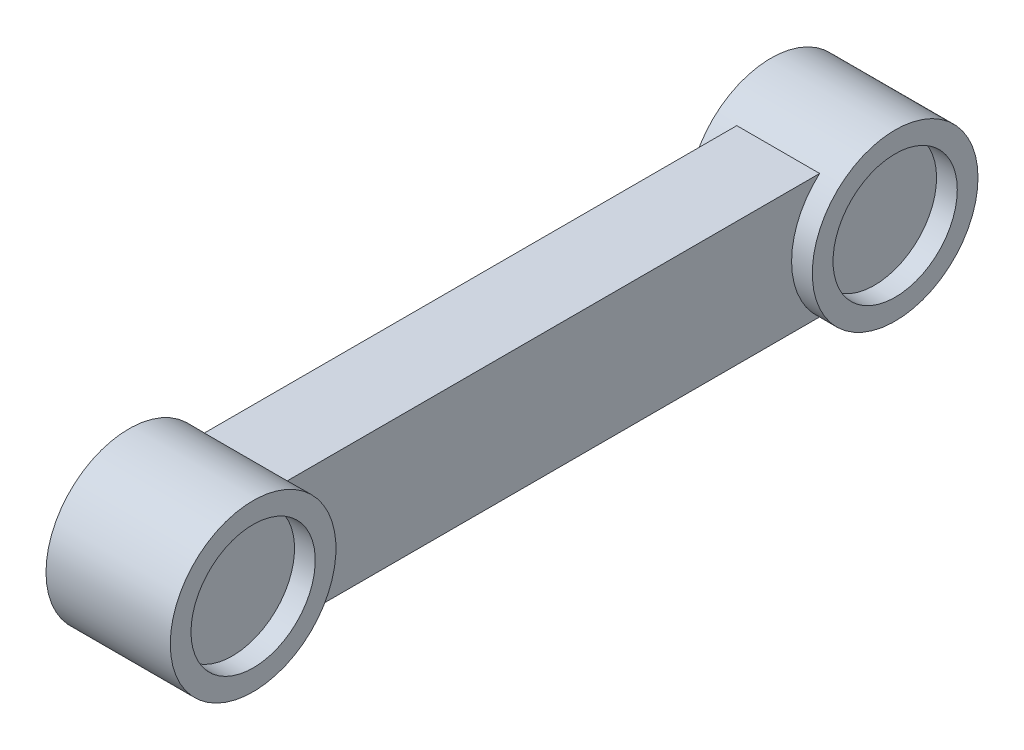
ISO-10303-21;
HEADER;
FILE_DESCRIPTION(('STEP AP214'),'2;1');
FILE_NAME('part.step','',(''),(''),'','','');
FILE_SCHEMA(('AUTOMOTIVE_DESIGN { 1 0 10303 214 1 1 1 1 }'));
ENDSEC;
DATA;
#1=APPLICATION_CONTEXT('core data for automotive mechanical design processes');
#2=APPLICATION_PROTOCOL_DEFINITION('international standard','automotive_design',2000,#1);
#3=PRODUCT_CONTEXT('',#1,'mechanical');
#4=PRODUCT('Part','Part','',(#3));
#5=PRODUCT_RELATED_PRODUCT_CATEGORY('part','',(#4));
#6=PRODUCT_DEFINITION_FORMATION('','',#4);
#7=PRODUCT_DEFINITION_CONTEXT('part definition',#1,'design');
#8=PRODUCT_DEFINITION('design','',#6,#7);
#9=PRODUCT_DEFINITION_SHAPE('','',#8);
#10=(LENGTH_UNIT() NAMED_UNIT(*) SI_UNIT(.MILLI.,.METRE.));
#11=(NAMED_UNIT(*) PLANE_ANGLE_UNIT() SI_UNIT($,.RADIAN.));
#12=(NAMED_UNIT(*) SI_UNIT($,.STERADIAN.) SOLID_ANGLE_UNIT());
#13=UNCERTAINTY_MEASURE_WITH_UNIT(LENGTH_MEASURE(1.E-05),#10,'distance_accuracy_value','');
#14=(GEOMETRIC_REPRESENTATION_CONTEXT(3) GLOBAL_UNCERTAINTY_ASSIGNED_CONTEXT((#13)) GLOBAL_UNIT_ASSIGNED_CONTEXT((#10,
#11,#12)) REPRESENTATION_CONTEXT('',''));
#15=CARTESIAN_POINT('',(0.,0.,0.));
#16=DIRECTION('',(0.,0.,1.));
#17=DIRECTION('',(1.,0.,0.));
#18=AXIS2_PLACEMENT_3D('',#15,#16,#17);
#19=CARTESIAN_POINT('',(60.,0.,0.));
#20=DIRECTION('',(-1.,0.,0.));
#21=DIRECTION('',(0.,0.,1.));
#22=AXIS2_PLACEMENT_3D('',#19,#20,#21);
#23=CYLINDRICAL_SURFACE('',#22,40.);
#24=CARTESIAN_POINT('',(0.,0.,0.));
#25=DIRECTION('',(1.,0.,0.));
#26=DIRECTION('',(0.,0.,-1.));
#27=AXIS2_PLACEMENT_3D('',#24,#25,#26);
#28=CIRCLE('',#27,40.);
#29=CARTESIAN_POINT('',(0.,0.,-40.));
#30=VERTEX_POINT('',#29);
#31=EDGE_CURVE('E41',#30,#30,#28,.T.);
#32=ORIENTED_EDGE('',*,*,#31,.T.);
#33=EDGE_LOOP('',(#32));
#34=FACE_BOUND('',#33,.T.);
#35=CARTESIAN_POINT('',(60.,0.,0.));
#36=DIRECTION('',(1.,0.,0.));
#37=DIRECTION('',(0.,0.,-1.));
#38=AXIS2_PLACEMENT_3D('',#35,#36,#37);
#39=CIRCLE('',#38,40.);
#40=CARTESIAN_POINT('',(60.,0.,-40.));
#41=VERTEX_POINT('',#40);
#42=EDGE_CURVE('E46',#41,#41,#39,.T.);
#43=ORIENTED_EDGE('',*,*,#42,.F.);
#44=EDGE_LOOP('',(#43));
#45=FACE_BOUND('',#44,.T.);
#46=DIRECTION('',(-1.,0.,0.));
#47=VECTOR('',#46,1.);
#48=CARTESIAN_POINT('',(60.,-30.0000000000002,26.4575131106457));
#49=LINE('',#48,#47);
#50=CARTESIAN_POINT('',(49.9999999999998,-30.0000000000002,26.4575131106457));
#51=VERTEX_POINT('',#50);
#52=CARTESIAN_POINT('',(9.99999999999886,-30.0000000000002,26.4575131106457));
#53=VERTEX_POINT('',#52);
#54=EDGE_CURVE('E109',#51,#53,#49,.T.);
#55=ORIENTED_EDGE('',*,*,#54,.T.);
#56=CARTESIAN_POINT('',(9.99999999999999,0.,0.));
#57=DIRECTION('',(1.,0.,0.));
#58=DIRECTION('',(0.,0.,-1.));
#59=AXIS2_PLACEMENT_3D('',#56,#57,#58);
#60=CIRCLE('',#59,40.);
#61=CARTESIAN_POINT('',(9.99999999999981,29.9999999999998,26.4575131106461));
#62=VERTEX_POINT('',#61);
#63=EDGE_CURVE('E94',#53,#62,#60,.F.);
#64=ORIENTED_EDGE('',*,*,#63,.T.);
#65=DIRECTION('',(-1.,0.,0.));
#66=VECTOR('',#65,1.);
#67=CARTESIAN_POINT('',(60.,29.9999999999998,26.4575131106461));
#68=LINE('',#67,#66);
#69=CARTESIAN_POINT('',(49.9999999999998,29.9999999999998,26.4575131106461));
#70=VERTEX_POINT('',#69);
#71=EDGE_CURVE('E59',#62,#70,#68,.F.);
#72=ORIENTED_EDGE('',*,*,#71,.T.);
#73=CARTESIAN_POINT('',(50.,0.,0.));
#74=DIRECTION('',(-1.,0.,0.));
#75=DIRECTION('',(0.,0.,1.));
#76=AXIS2_PLACEMENT_3D('',#73,#74,#75);
#77=CIRCLE('',#76,40.);
#78=EDGE_CURVE('E54',#70,#51,#77,.F.);
#79=ORIENTED_EDGE('',*,*,#78,.T.);
#80=EDGE_LOOP('',(#55,#64,#72,#79));
#81=FACE_BOUND('',#80,.T.);
#82=ADVANCED_FACE('F38',(#34,#45,#81),#23,.T.);
#83=CARTESIAN_POINT('',(60.,0.,0.));
#84=DIRECTION('',(1.,0.,0.));
#85=DIRECTION('',(0.,0.,-1.));
#86=AXIS2_PLACEMENT_3D('',#83,#84,#85);
#87=PLANE('',#86);
#88=CARTESIAN_POINT('',(60.,0.,0.));
#89=DIRECTION('',(1.,0.,0.));
#90=DIRECTION('',(0.,0.,-1.));
#91=AXIS2_PLACEMENT_3D('',#88,#89,#90);
#92=CIRCLE('',#91,30.);
#93=CARTESIAN_POINT('',(60.,0.,-30.));
#94=VERTEX_POINT('',#93);
#95=EDGE_CURVE('E320',#94,#94,#92,.T.);
#96=ORIENTED_EDGE('',*,*,#95,.F.);
#97=EDGE_LOOP('',(#96));
#98=FACE_BOUND('',#97,.T.);
#99=ORIENTED_EDGE('',*,*,#42,.T.);
#100=EDGE_LOOP('',(#99));
#101=FACE_BOUND('',#100,.T.);
#102=ADVANCED_FACE('F126',(#98,#101),#87,.T.);
#103=CARTESIAN_POINT('',(0.,0.,0.));
#104=DIRECTION('',(1.,0.,0.));
#105=DIRECTION('',(0.,0.,-1.));
#106=AXIS2_PLACEMENT_3D('',#103,#104,#105);
#107=PLANE('',#106);
#108=CARTESIAN_POINT('',(0.,0.,0.));
#109=DIRECTION('',(-1.,0.,0.));
#110=DIRECTION('',(0.,0.,1.));
#111=AXIS2_PLACEMENT_3D('',#108,#109,#110);
#112=CIRCLE('',#111,6.);
#113=CARTESIAN_POINT('',(0.,0.,6.));
#114=VERTEX_POINT('',#113);
#115=EDGE_CURVE('E305',#114,#114,#112,.T.);
#116=ORIENTED_EDGE('',*,*,#115,.F.);
#117=EDGE_LOOP('',(#116));
#118=FACE_BOUND('',#117,.T.);
#119=ORIENTED_EDGE('',*,*,#31,.F.);
#120=EDGE_LOOP('',(#119));
#121=FACE_BOUND('',#120,.T.);
#122=ADVANCED_FACE('F124',(#118,#121),#107,.F.);
#123=CARTESIAN_POINT('',(50.0000000000003,-29.9999999999997,-40.0010000000006));
#124=DIRECTION('',(0.,1.,0.));
#125=DIRECTION('',(0.,0.,1.));
#126=AXIS2_PLACEMENT_3D('',#123,#124,#125);
#127=PLANE('',#126);
#128=ORIENTED_EDGE('',*,*,#54,.F.);
#129=DIRECTION('',(0.,0.,1.));
#130=VECTOR('',#129,1.);
#131=CARTESIAN_POINT('',(50.0000000000003,-29.9999999999997,-40.0010000000006));
#132=LINE('',#131,#130);
#133=CARTESIAN_POINT('',(49.999999999998,-30.000000000002,283.520890904847));
#134=VERTEX_POINT('',#133);
#135=EDGE_CURVE('E97',#51,#134,#132,.T.);
#136=ORIENTED_EDGE('',*,*,#135,.T.);
#137=DIRECTION('',(-1.,0.,0.));
#138=VECTOR('',#137,1.);
#139=CARTESIAN_POINT('',(60.,-30.000000000002,283.520890904847));
#140=LINE('',#139,#138);
#141=CARTESIAN_POINT('',(9.99999999999801,-30.000000000002,283.520890904847));
#142=VERTEX_POINT('',#141);
#143=EDGE_CURVE('E81',#134,#142,#140,.T.);
#144=ORIENTED_EDGE('',*,*,#143,.T.);
#145=DIRECTION('',(0.,0.,1.));
#146=VECTOR('',#145,1.);
#147=CARTESIAN_POINT('',(10.0000000000003,-29.9999999999997,-40.0010000000008));
#148=LINE('',#147,#146);
#149=EDGE_CURVE('E92',#53,#142,#148,.T.);
#150=ORIENTED_EDGE('',*,*,#149,.F.);
#151=EDGE_LOOP('',(#128,#136,#144,#150));
#152=FACE_BOUND('',#151,.T.);
#153=ADVANCED_FACE('F99',(#152),#127,.F.);
#154=CARTESIAN_POINT('',(50.0000000000003,30.0000000000003,-40.0010000000001));
#155=DIRECTION('',(-1.,0.,0.));
#156=DIRECTION('',(0.,0.,1.));
#157=AXIS2_PLACEMENT_3D('',#154,#155,#156);
#158=PLANE('',#157);
#159=ORIENTED_EDGE('',*,*,#78,.F.);
#160=DIRECTION('',(0.,0.,1.));
#161=VECTOR('',#160,1.);
#162=CARTESIAN_POINT('',(50.0000000000003,30.0000000000003,-40.0010000000001));
#163=LINE('',#162,#161);
#164=CARTESIAN_POINT('',(49.9999999999998,29.999999999998,283.520890904842));
#165=VERTEX_POINT('',#164);
#166=EDGE_CURVE('E112',#70,#165,#163,.T.);
#167=ORIENTED_EDGE('',*,*,#166,.T.);
#168=CARTESIAN_POINT('',(49.9999999999978,0.,309.97840401549));
#169=DIRECTION('',(1.,0.,0.));
#170=DIRECTION('',(0.,0.,-1.));
#171=AXIS2_PLACEMENT_3D('',#168,#169,#170);
#172=CIRCLE('',#171,40.);
#173=EDGE_CURVE('E101',#165,#134,#172,.F.);
#174=ORIENTED_EDGE('',*,*,#173,.T.);
#175=ORIENTED_EDGE('',*,*,#135,.F.);
#176=EDGE_LOOP('',(#159,#167,#174,#175));
#177=FACE_BOUND('',#176,.T.);
#178=ADVANCED_FACE('F132',(#177),#158,.F.);
#179=CARTESIAN_POINT('',(50.0000000000003,30.0000000000003,-40.0010000000001));
#180=DIRECTION('',(0.,-1.,0.));
#181=DIRECTION('',(0.,0.,-1.));
#182=AXIS2_PLACEMENT_3D('',#179,#180,#181);
#183=PLANE('',#182);
#184=ORIENTED_EDGE('',*,*,#71,.F.);
#185=DIRECTION('',(0.,0.,1.));
#186=VECTOR('',#185,1.);
#187=CARTESIAN_POINT('',(10.0000000000003,30.0000000000003,-40.0010000000004));
#188=LINE('',#187,#186);
#189=CARTESIAN_POINT('',(9.99999999999756,29.999999999998,283.520890904842));
#190=VERTEX_POINT('',#189);
#191=EDGE_CURVE('E107',#62,#190,#188,.T.);
#192=ORIENTED_EDGE('',*,*,#191,.T.);
#193=DIRECTION('',(-1.,0.,0.));
#194=VECTOR('',#193,1.);
#195=CARTESIAN_POINT('',(60.,29.999999999998,283.520890904842));
#196=LINE('',#195,#194);
#197=EDGE_CURVE('E84',#190,#165,#196,.F.);
#198=ORIENTED_EDGE('',*,*,#197,.T.);
#199=ORIENTED_EDGE('',*,*,#166,.F.);
#200=EDGE_LOOP('',(#184,#192,#198,#199));
#201=FACE_BOUND('',#200,.T.);
#202=ADVANCED_FACE('F233',(#201),#183,.F.);
#203=CARTESIAN_POINT('',(10.0000000000003,30.0000000000003,-40.0010000000004));
#204=DIRECTION('',(1.,0.,0.));
#205=DIRECTION('',(0.,0.,-1.));
#206=AXIS2_PLACEMENT_3D('',#203,#204,#205);
#207=PLANE('',#206);
#208=ORIENTED_EDGE('',*,*,#63,.F.);
#209=ORIENTED_EDGE('',*,*,#149,.T.);
#210=CARTESIAN_POINT('',(9.99999999999783,0.,309.97840401549));
#211=DIRECTION('',(-1.,0.,0.));
#212=DIRECTION('',(0.,0.,1.));
#213=AXIS2_PLACEMENT_3D('',#210,#211,#212);
#214=CIRCLE('',#213,40.);
#215=EDGE_CURVE('E77',#142,#190,#214,.F.);
#216=ORIENTED_EDGE('',*,*,#215,.T.);
#217=ORIENTED_EDGE('',*,*,#191,.F.);
#218=EDGE_LOOP('',(#208,#209,#216,#217));
#219=FACE_BOUND('',#218,.T.);
#220=ADVANCED_FACE('F93',(#219),#207,.F.);
#221=CARTESIAN_POINT('',(60.,0.,309.97840401549));
#222=DIRECTION('',(-1.,0.,0.));
#223=DIRECTION('',(0.,0.,1.));
#224=AXIS2_PLACEMENT_3D('',#221,#222,#223);
#225=CYLINDRICAL_SURFACE('',#224,40.);
#226=CARTESIAN_POINT('',(60.,0.,309.97840401549));
#227=DIRECTION('',(1.,0.,0.));
#228=DIRECTION('',(0.,0.,1.));
#229=AXIS2_PLACEMENT_3D('',#226,#227,#228);
#230=CIRCLE('',#229,40.);
#231=CARTESIAN_POINT('',(60.,0.,349.97840401549));
#232=VERTEX_POINT('',#231);
#233=EDGE_CURVE('E88',#232,#232,#230,.T.);
#234=ORIENTED_EDGE('',*,*,#233,.F.);
#235=EDGE_LOOP('',(#234));
#236=FACE_BOUND('',#235,.T.);
#237=CARTESIAN_POINT('',(0.,0.,309.97840401549));
#238=DIRECTION('',(1.,0.,0.));
#239=DIRECTION('',(0.,0.,1.));
#240=AXIS2_PLACEMENT_3D('',#237,#238,#239);
#241=CIRCLE('',#240,40.);
#242=CARTESIAN_POINT('',(0.,0.,349.97840401549));
#243=VERTEX_POINT('',#242);
#244=EDGE_CURVE('E299',#243,#243,#241,.T.);
#245=ORIENTED_EDGE('',*,*,#244,.T.);
#246=EDGE_LOOP('',(#245));
#247=FACE_BOUND('',#246,.T.);
#248=ORIENTED_EDGE('',*,*,#215,.F.);
#249=ORIENTED_EDGE('',*,*,#143,.F.);
#250=ORIENTED_EDGE('',*,*,#173,.F.);
#251=ORIENTED_EDGE('',*,*,#197,.F.);
#252=EDGE_LOOP('',(#248,#249,#250,#251));
#253=FACE_BOUND('',#252,.T.);
#254=ADVANCED_FACE('F79',(#236,#247,#253),#225,.T.);
#255=CARTESIAN_POINT('',(60.,0.,309.97840401549));
#256=DIRECTION('',(-1.,0.,0.));
#257=DIRECTION('',(0.,0.,1.));
#258=AXIS2_PLACEMENT_3D('',#255,#256,#257);
#259=PLANE('',#258);
#260=CARTESIAN_POINT('',(60.,0.,309.97840401549));
#261=DIRECTION('',(1.,0.,0.));
#262=DIRECTION('',(0.,0.,1.));
#263=AXIS2_PLACEMENT_3D('',#260,#261,#262);
#264=CIRCLE('',#263,30.);
#265=CARTESIAN_POINT('',(60.,0.,339.978404015491));
#266=VERTEX_POINT('',#265);
#267=EDGE_CURVE('E314',#266,#266,#264,.T.);
#268=ORIENTED_EDGE('',*,*,#267,.F.);
#269=EDGE_LOOP('',(#268));
#270=FACE_BOUND('',#269,.T.);
#271=ORIENTED_EDGE('',*,*,#233,.T.);
#272=EDGE_LOOP('',(#271));
#273=FACE_BOUND('',#272,.T.);
#274=ADVANCED_FACE('F157',(#270,#273),#259,.F.);
#275=CARTESIAN_POINT('',(0.,0.,309.97840401549));
#276=DIRECTION('',(-1.,0.,0.));
#277=DIRECTION('',(0.,0.,1.));
#278=AXIS2_PLACEMENT_3D('',#275,#276,#277);
#279=PLANE('',#278);
#280=CARTESIAN_POINT('',(0.,0.,309.97840401549));
#281=DIRECTION('',(-1.,0.,0.));
#282=DIRECTION('',(0.,0.,1.));
#283=AXIS2_PLACEMENT_3D('',#280,#281,#282);
#284=CIRCLE('',#283,5.99999999999999);
#285=CARTESIAN_POINT('',(0.,0.,315.97840401549));
#286=VERTEX_POINT('',#285);
#287=EDGE_CURVE('E11',#286,#286,#284,.T.);
#288=ORIENTED_EDGE('',*,*,#287,.F.);
#289=EDGE_LOOP('',(#288));
#290=FACE_BOUND('',#289,.T.);
#291=ORIENTED_EDGE('',*,*,#244,.F.);
#292=EDGE_LOOP('',(#291));
#293=FACE_BOUND('',#292,.T.);
#294=ADVANCED_FACE('F162',(#290,#293),#279,.T.);
#295=CARTESIAN_POINT('',(10.,0.,0.));
#296=DIRECTION('',(-1.,0.,0.));
#297=DIRECTION('',(0.,0.,1.));
#298=AXIS2_PLACEMENT_3D('',#295,#296,#297);
#299=CYLINDRICAL_SURFACE('',#298,6.);
#300=CARTESIAN_POINT('',(10.,0.,0.));
#301=DIRECTION('',(-1.,0.,0.));
#302=DIRECTION('',(0.,0.,1.));
#303=AXIS2_PLACEMENT_3D('',#300,#301,#302);
#304=CIRCLE('',#303,6.);
#305=CARTESIAN_POINT('',(10.,0.,6.));
#306=VERTEX_POINT('',#305);
#307=EDGE_CURVE('E302',#306,#306,#304,.T.);
#308=ORIENTED_EDGE('',*,*,#307,.F.);
#309=EDGE_LOOP('',(#308));
#310=FACE_BOUND('',#309,.T.);
#311=ORIENTED_EDGE('',*,*,#115,.T.);
#312=EDGE_LOOP('',(#311));
#313=FACE_BOUND('',#312,.T.);
#314=ADVANCED_FACE('F222',(#310,#313),#299,.F.);
#315=CARTESIAN_POINT('',(10.,0.,0.));
#316=DIRECTION('',(-1.,0.,0.));
#317=DIRECTION('',(0.,0.,1.));
#318=AXIS2_PLACEMENT_3D('',#315,#316,#317);
#319=PLANE('',#318);
#320=ORIENTED_EDGE('',*,*,#307,.T.);
#321=EDGE_LOOP('',(#320));
#322=FACE_BOUND('',#321,.T.);
#323=ADVANCED_FACE('F218',(#322),#319,.T.);
#324=CARTESIAN_POINT('',(-10.,0.,309.97840401549));
#325=DIRECTION('',(1.,0.,0.));
#326=DIRECTION('',(0.,0.,-1.));
#327=AXIS2_PLACEMENT_3D('',#324,#325,#326);
#328=CYLINDRICAL_SURFACE('',#327,5.99999999999999);
#329=CARTESIAN_POINT('',(-10.,0.,309.97840401549));
#330=DIRECTION('',(-1.,0.,0.));
#331=DIRECTION('',(0.,0.,1.));
#332=AXIS2_PLACEMENT_3D('',#329,#330,#331);
#333=CIRCLE('',#332,5.99999999999999);
#334=CARTESIAN_POINT('',(-10.,0.,315.97840401549));
#335=VERTEX_POINT('',#334);
#336=EDGE_CURVE('E308',#335,#335,#333,.T.);
#337=ORIENTED_EDGE('',*,*,#336,.F.);
#338=EDGE_LOOP('',(#337));
#339=FACE_BOUND('',#338,.T.);
#340=ORIENTED_EDGE('',*,*,#287,.T.);
#341=EDGE_LOOP('',(#340));
#342=FACE_BOUND('',#341,.T.);
#343=ADVANCED_FACE('F214',(#339,#342),#328,.T.);
#344=CARTESIAN_POINT('',(-10.,0.,309.97840401549));
#345=DIRECTION('',(-1.,0.,0.));
#346=DIRECTION('',(0.,0.,1.));
#347=AXIS2_PLACEMENT_3D('',#344,#345,#346);
#348=PLANE('',#347);
#349=ORIENTED_EDGE('',*,*,#336,.T.);
#350=EDGE_LOOP('',(#349));
#351=FACE_BOUND('',#350,.T.);
#352=ADVANCED_FACE('F152',(#351),#348,.T.);
#353=CARTESIAN_POINT('',(50.,0.,309.97840401549));
#354=DIRECTION('',(1.,0.,0.));
#355=DIRECTION('',(0.,0.,-1.));
#356=AXIS2_PLACEMENT_3D('',#353,#354,#355);
#357=CYLINDRICAL_SURFACE('',#356,30.);
#358=CARTESIAN_POINT('',(50.,0.,309.97840401549));
#359=DIRECTION('',(1.,0.,0.));
#360=DIRECTION('',(0.,0.,1.));
#361=AXIS2_PLACEMENT_3D('',#358,#359,#360);
#362=CIRCLE('',#361,30.);
#363=CARTESIAN_POINT('',(50.,0.,339.978404015491));
#364=VERTEX_POINT('',#363);
#365=EDGE_CURVE('E317',#364,#364,#362,.T.);
#366=ORIENTED_EDGE('',*,*,#365,.F.);
#367=EDGE_LOOP('',(#366));
#368=FACE_BOUND('',#367,.T.);
#369=ORIENTED_EDGE('',*,*,#267,.T.);
#370=EDGE_LOOP('',(#369));
#371=FACE_BOUND('',#370,.T.);
#372=ADVANCED_FACE('F172',(#368,#371),#357,.F.);
#373=CARTESIAN_POINT('',(50.,0.,309.97840401549));
#374=DIRECTION('',(-1.,0.,0.));
#375=DIRECTION('',(0.,0.,1.));
#376=AXIS2_PLACEMENT_3D('',#373,#374,#375);
#377=PLANE('',#376);
#378=ORIENTED_EDGE('',*,*,#365,.T.);
#379=EDGE_LOOP('',(#378));
#380=FACE_BOUND('',#379,.T.);
#381=ADVANCED_FACE('F177',(#380),#377,.F.);
#382=CARTESIAN_POINT('',(50.,0.,0.));
#383=DIRECTION('',(1.,0.,0.));
#384=DIRECTION('',(0.,0.,-1.));
#385=AXIS2_PLACEMENT_3D('',#382,#383,#384);
#386=CYLINDRICAL_SURFACE('',#385,30.);
#387=CARTESIAN_POINT('',(50.,0.,0.));
#388=DIRECTION('',(1.,0.,0.));
#389=DIRECTION('',(0.,0.,-1.));
#390=AXIS2_PLACEMENT_3D('',#387,#388,#389);
#391=CIRCLE('',#390,30.);
#392=CARTESIAN_POINT('',(50.,0.,-30.));
#393=VERTEX_POINT('',#392);
#394=EDGE_CURVE('E313',#393,#393,#391,.T.);
#395=ORIENTED_EDGE('',*,*,#394,.F.);
#396=EDGE_LOOP('',(#395));
#397=FACE_BOUND('',#396,.T.);
#398=ORIENTED_EDGE('',*,*,#95,.T.);
#399=EDGE_LOOP('',(#398));
#400=FACE_BOUND('',#399,.T.);
#401=ADVANCED_FACE('F187',(#397,#400),#386,.F.);
#402=CARTESIAN_POINT('',(50.,0.,0.));
#403=DIRECTION('',(1.,0.,0.));
#404=DIRECTION('',(0.,0.,-1.));
#405=AXIS2_PLACEMENT_3D('',#402,#403,#404);
#406=PLANE('',#405);
#407=ORIENTED_EDGE('',*,*,#394,.T.);
#408=EDGE_LOOP('',(#407));
#409=FACE_BOUND('',#408,.T.);
#410=ADVANCED_FACE('F197',(#409),#406,.T.);
#411=CLOSED_SHELL('',(#82,#102,#122,#153,#178,#202,#220,#254,#274,#294,#314,#323,#343,#352,#372,
#381,#401,#410));
#412=MANIFOLD_SOLID_BREP('B2',#411);
#413=ADVANCED_BREP_SHAPE_REPRESENTATION('',(#18,#412),#14);
#414=SHAPE_DEFINITION_REPRESENTATION(#9,#413);
ENDSEC;
END-ISO-10303-21;
